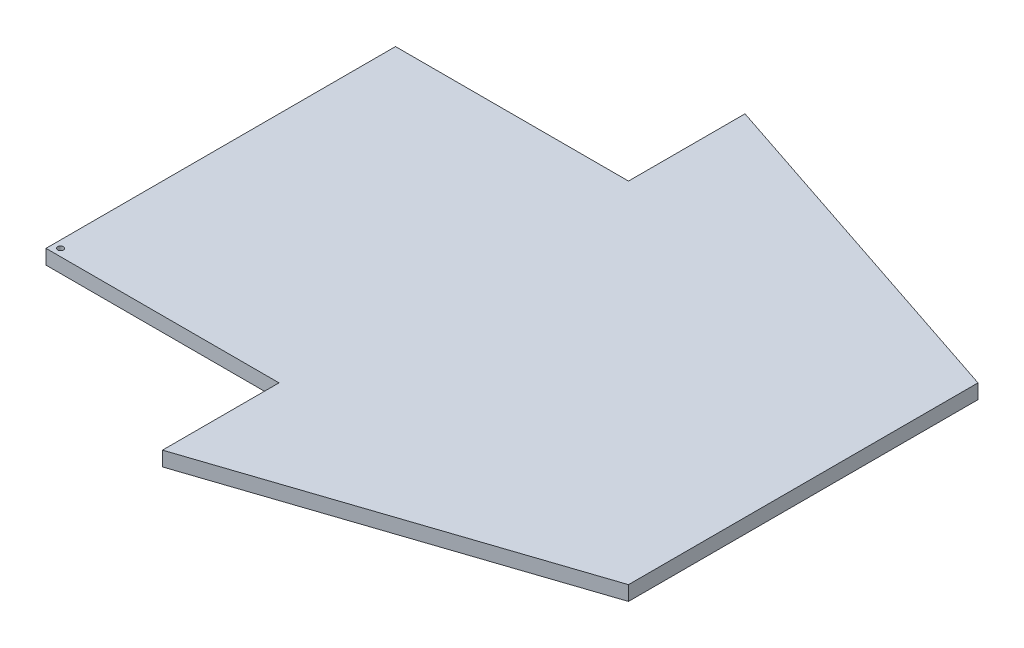
ISO-10303-21;
HEADER;
FILE_DESCRIPTION(('STEP AP214'),'2;1');
FILE_NAME('part.step','',(''),(''),'','','');
FILE_SCHEMA(('AUTOMOTIVE_DESIGN { 1 0 10303 214 1 1 1 1 }'));
ENDSEC;
DATA;
#1=APPLICATION_CONTEXT('core data for automotive mechanical design processes');
#2=APPLICATION_PROTOCOL_DEFINITION('international standard','automotive_design',2000,#1);
#3=PRODUCT_CONTEXT('',#1,'mechanical');
#4=PRODUCT('Part','Part','',(#3));
#5=PRODUCT_RELATED_PRODUCT_CATEGORY('part','',(#4));
#6=PRODUCT_DEFINITION_FORMATION('','',#4);
#7=PRODUCT_DEFINITION_CONTEXT('part definition',#1,'design');
#8=PRODUCT_DEFINITION('design','',#6,#7);
#9=PRODUCT_DEFINITION_SHAPE('','',#8);
#10=(LENGTH_UNIT() NAMED_UNIT(*) SI_UNIT(.MILLI.,.METRE.));
#11=(NAMED_UNIT(*) PLANE_ANGLE_UNIT() SI_UNIT($,.RADIAN.));
#12=(NAMED_UNIT(*) SI_UNIT($,.STERADIAN.) SOLID_ANGLE_UNIT());
#13=UNCERTAINTY_MEASURE_WITH_UNIT(LENGTH_MEASURE(1.E-05),#10,'distance_accuracy_value','');
#14=(GEOMETRIC_REPRESENTATION_CONTEXT(3) GLOBAL_UNCERTAINTY_ASSIGNED_CONTEXT((#13)) GLOBAL_UNIT_ASSIGNED_CONTEXT((#10,
#11,#12)) REPRESENTATION_CONTEXT('',''));
#15=CARTESIAN_POINT('',(0.,0.,0.));
#16=DIRECTION('',(0.,0.,1.));
#17=DIRECTION('',(1.,0.,0.));
#18=AXIS2_PLACEMENT_3D('',#15,#16,#17);
#19=CARTESIAN_POINT('',(0.,6.35,0.));
#20=DIRECTION('',(1.,0.,0.));
#21=DIRECTION('',(0.,0.,-1.));
#22=AXIS2_PLACEMENT_3D('',#19,#20,#21);
#23=PLANE('',#22);
#24=DIRECTION('',(0.,0.,1.));
#25=VECTOR('',#24,1.);
#26=CARTESIAN_POINT('',(0.,0.,0.));
#27=LINE('',#26,#25);
#28=CARTESIAN_POINT('',(0.,0.,-50.8));
#29=VERTEX_POINT('',#28);
#30=CARTESIAN_POINT('',(0.,0.,0.));
#31=VERTEX_POINT('',#30);
#32=EDGE_CURVE('E130',#29,#31,#27,.T.);
#33=ORIENTED_EDGE('',*,*,#32,.T.);
#34=DIRECTION('',(0.,-1.,0.));
#35=VECTOR('',#34,1.);
#36=CARTESIAN_POINT('',(0.,6.35,0.));
#37=LINE('',#36,#35);
#38=CARTESIAN_POINT('',(0.,6.35,0.));
#39=VERTEX_POINT('',#38);
#40=EDGE_CURVE('E11',#39,#31,#37,.T.);
#41=ORIENTED_EDGE('',*,*,#40,.F.);
#42=DIRECTION('',(0.,0.,1.));
#43=VECTOR('',#42,1.);
#44=CARTESIAN_POINT('',(0.,6.35,0.));
#45=LINE('',#44,#43);
#46=CARTESIAN_POINT('',(0.,6.35,-50.8));
#47=VERTEX_POINT('',#46);
#48=EDGE_CURVE('E145',#47,#39,#45,.T.);
#49=ORIENTED_EDGE('',*,*,#48,.F.);
#50=DIRECTION('',(0.,-1.,0.));
#51=VECTOR('',#50,1.);
#52=CARTESIAN_POINT('',(0.,6.35,-50.8));
#53=LINE('',#52,#51);
#54=EDGE_CURVE('E126',#47,#29,#53,.T.);
#55=ORIENTED_EDGE('',*,*,#54,.T.);
#56=EDGE_LOOP('',(#33,#41,#49,#55));
#57=FACE_BOUND('',#56,.T.);
#58=ADVANCED_FACE('F34',(#57),#23,.F.);
#59=CARTESIAN_POINT('',(152.4,6.35,-50.8));
#60=DIRECTION('',(-0.316227766016838,0.,-0.948683298050514));
#61=DIRECTION('',(-0.948683298050514,0.,0.316227766016838));
#62=AXIS2_PLACEMENT_3D('',#59,#60,#61);
#63=PLANE('',#62);
#64=DIRECTION('',(0.948683298050514,0.,-0.316227766016838));
#65=VECTOR('',#64,1.);
#66=CARTESIAN_POINT('',(152.4,0.,-50.8));
#67=LINE('',#66,#65);
#68=CARTESIAN_POINT('',(152.4,0.,-50.8));
#69=VERTEX_POINT('',#68);
#70=EDGE_CURVE('E133',#31,#69,#67,.T.);
#71=ORIENTED_EDGE('',*,*,#70,.T.);
#72=DIRECTION('',(0.,-1.,0.));
#73=VECTOR('',#72,1.);
#74=CARTESIAN_POINT('',(152.4,6.35,-50.8));
#75=LINE('',#74,#73);
#76=CARTESIAN_POINT('',(152.4,6.35,-50.8));
#77=VERTEX_POINT('',#76);
#78=EDGE_CURVE('E42',#77,#69,#75,.T.);
#79=ORIENTED_EDGE('',*,*,#78,.F.);
#80=DIRECTION('',(0.948683298050514,0.,-0.316227766016838));
#81=VECTOR('',#80,1.);
#82=CARTESIAN_POINT('',(152.4,6.35,-50.8));
#83=LINE('',#82,#81);
#84=EDGE_CURVE('E93',#39,#77,#83,.T.);
#85=ORIENTED_EDGE('',*,*,#84,.F.);
#86=ORIENTED_EDGE('',*,*,#40,.T.);
#87=EDGE_LOOP('',(#71,#79,#85,#86));
#88=FACE_BOUND('',#87,.T.);
#89=ADVANCED_FACE('F200',(#88),#63,.F.);
#90=CARTESIAN_POINT('',(152.4,6.35,-203.2));
#91=DIRECTION('',(-1.,0.,0.));
#92=DIRECTION('',(0.,0.,1.));
#93=AXIS2_PLACEMENT_3D('',#90,#91,#92);
#94=PLANE('',#93);
#95=DIRECTION('',(0.,0.,-1.));
#96=VECTOR('',#95,1.);
#97=CARTESIAN_POINT('',(152.4,0.,-203.2));
#98=LINE('',#97,#96);
#99=CARTESIAN_POINT('',(152.4,0.,-203.2));
#100=VERTEX_POINT('',#99);
#101=EDGE_CURVE('E136',#69,#100,#98,.T.);
#102=ORIENTED_EDGE('',*,*,#101,.T.);
#103=DIRECTION('',(0.,-1.,0.));
#104=VECTOR('',#103,1.);
#105=CARTESIAN_POINT('',(152.4,6.35,-203.2));
#106=LINE('',#105,#104);
#107=CARTESIAN_POINT('',(152.4,6.35,-203.2));
#108=VERTEX_POINT('',#107);
#109=EDGE_CURVE('E152',#108,#100,#106,.T.);
#110=ORIENTED_EDGE('',*,*,#109,.F.);
#111=DIRECTION('',(0.,0.,-1.));
#112=VECTOR('',#111,1.);
#113=CARTESIAN_POINT('',(152.4,6.35,-203.2));
#114=LINE('',#113,#112);
#115=EDGE_CURVE('E160',#77,#108,#114,.T.);
#116=ORIENTED_EDGE('',*,*,#115,.F.);
#117=ORIENTED_EDGE('',*,*,#78,.T.);
#118=EDGE_LOOP('',(#102,#110,#116,#117));
#119=FACE_BOUND('',#118,.T.);
#120=ADVANCED_FACE('F158',(#119),#94,.F.);
#121=CARTESIAN_POINT('',(0.,6.35,-254.));
#122=DIRECTION('',(-0.316227766016838,0.,0.948683298050514));
#123=DIRECTION('',(0.948683298050514,0.,0.316227766016838));
#124=AXIS2_PLACEMENT_3D('',#121,#122,#123);
#125=PLANE('',#124);
#126=DIRECTION('',(-0.948683298050514,0.,-0.316227766016838));
#127=VECTOR('',#126,1.);
#128=CARTESIAN_POINT('',(0.,0.,-254.));
#129=LINE('',#128,#127);
#130=CARTESIAN_POINT('',(0.,0.,-254.));
#131=VERTEX_POINT('',#130);
#132=EDGE_CURVE('E138',#100,#131,#129,.T.);
#133=ORIENTED_EDGE('',*,*,#132,.T.);
#134=DIRECTION('',(0.,-1.,0.));
#135=VECTOR('',#134,1.);
#136=CARTESIAN_POINT('',(0.,6.35,-254.));
#137=LINE('',#136,#135);
#138=CARTESIAN_POINT('',(0.,6.35,-254.));
#139=VERTEX_POINT('',#138);
#140=EDGE_CURVE('E149',#139,#131,#137,.T.);
#141=ORIENTED_EDGE('',*,*,#140,.F.);
#142=DIRECTION('',(-0.948683298050514,0.,-0.316227766016838));
#143=VECTOR('',#142,1.);
#144=CARTESIAN_POINT('',(0.,6.35,-254.));
#145=LINE('',#144,#143);
#146=EDGE_CURVE('E172',#108,#139,#145,.T.);
#147=ORIENTED_EDGE('',*,*,#146,.F.);
#148=ORIENTED_EDGE('',*,*,#109,.T.);
#149=EDGE_LOOP('',(#133,#141,#147,#148));
#150=FACE_BOUND('',#149,.T.);
#151=ADVANCED_FACE('F168',(#150),#125,.F.);
#152=CARTESIAN_POINT('',(0.,6.35,-203.2));
#153=DIRECTION('',(1.,0.,0.));
#154=DIRECTION('',(0.,0.,-1.));
#155=AXIS2_PLACEMENT_3D('',#152,#153,#154);
#156=PLANE('',#155);
#157=DIRECTION('',(0.,0.,1.));
#158=VECTOR('',#157,1.);
#159=CARTESIAN_POINT('',(0.,0.,-203.2));
#160=LINE('',#159,#158);
#161=CARTESIAN_POINT('',(0.,0.,-203.2));
#162=VERTEX_POINT('',#161);
#163=EDGE_CURVE('E140',#131,#162,#160,.T.);
#164=ORIENTED_EDGE('',*,*,#163,.T.);
#165=DIRECTION('',(0.,-1.,0.));
#166=VECTOR('',#165,1.);
#167=CARTESIAN_POINT('',(0.,6.35,-203.2));
#168=LINE('',#167,#166);
#169=CARTESIAN_POINT('',(0.,6.35,-203.2));
#170=VERTEX_POINT('',#169);
#171=EDGE_CURVE('E121',#170,#162,#168,.T.);
#172=ORIENTED_EDGE('',*,*,#171,.F.);
#173=DIRECTION('',(0.,0.,1.));
#174=VECTOR('',#173,1.);
#175=CARTESIAN_POINT('',(0.,6.35,-203.2));
#176=LINE('',#175,#174);
#177=EDGE_CURVE('E112',#139,#170,#176,.T.);
#178=ORIENTED_EDGE('',*,*,#177,.F.);
#179=ORIENTED_EDGE('',*,*,#140,.T.);
#180=EDGE_LOOP('',(#164,#172,#178,#179));
#181=FACE_BOUND('',#180,.T.);
#182=ADVANCED_FACE('F171',(#181),#156,.F.);
#183=CARTESIAN_POINT('',(-101.6,6.35,-203.2));
#184=DIRECTION('',(0.,0.,1.));
#185=DIRECTION('',(1.,0.,0.));
#186=AXIS2_PLACEMENT_3D('',#183,#184,#185);
#187=PLANE('',#186);
#188=DIRECTION('',(-1.,0.,0.));
#189=VECTOR('',#188,1.);
#190=CARTESIAN_POINT('',(-101.6,0.,-203.2));
#191=LINE('',#190,#189);
#192=CARTESIAN_POINT('',(-101.6,0.,-203.2));
#193=VERTEX_POINT('',#192);
#194=EDGE_CURVE('E120',#162,#193,#191,.T.);
#195=ORIENTED_EDGE('',*,*,#194,.T.);
#196=DIRECTION('',(0.,-1.,0.));
#197=VECTOR('',#196,1.);
#198=CARTESIAN_POINT('',(-101.6,6.35,-203.2));
#199=LINE('',#198,#197);
#200=CARTESIAN_POINT('',(-101.6,6.35,-203.2));
#201=VERTEX_POINT('',#200);
#202=EDGE_CURVE('E117',#201,#193,#199,.T.);
#203=ORIENTED_EDGE('',*,*,#202,.F.);
#204=DIRECTION('',(-1.,0.,0.));
#205=VECTOR('',#204,1.);
#206=CARTESIAN_POINT('',(-101.6,6.35,-203.2));
#207=LINE('',#206,#205);
#208=EDGE_CURVE('E106',#170,#201,#207,.T.);
#209=ORIENTED_EDGE('',*,*,#208,.F.);
#210=ORIENTED_EDGE('',*,*,#171,.T.);
#211=EDGE_LOOP('',(#195,#203,#209,#210));
#212=FACE_BOUND('',#211,.T.);
#213=ADVANCED_FACE('F118',(#212),#187,.F.);
#214=CARTESIAN_POINT('',(-101.6,6.35,-50.7999999999999));
#215=DIRECTION('',(1.,0.,0.));
#216=DIRECTION('',(0.,0.,-1.));
#217=AXIS2_PLACEMENT_3D('',#214,#215,#216);
#218=PLANE('',#217);
#219=DIRECTION('',(0.,0.,1.));
#220=VECTOR('',#219,1.);
#221=CARTESIAN_POINT('',(-101.6,0.,-50.7999999999999));
#222=LINE('',#221,#220);
#223=CARTESIAN_POINT('',(-101.6,0.,-50.7999999999999));
#224=VERTEX_POINT('',#223);
#225=EDGE_CURVE('E79',#193,#224,#222,.T.);
#226=ORIENTED_EDGE('',*,*,#225,.T.);
#227=DIRECTION('',(0.,-1.,0.));
#228=VECTOR('',#227,1.);
#229=CARTESIAN_POINT('',(-101.6,6.35,-50.7999999999999));
#230=LINE('',#229,#228);
#231=CARTESIAN_POINT('',(-101.6,6.35,-50.7999999999999));
#232=VERTEX_POINT('',#231);
#233=EDGE_CURVE('E122',#232,#224,#230,.T.);
#234=ORIENTED_EDGE('',*,*,#233,.F.);
#235=DIRECTION('',(0.,0.,1.));
#236=VECTOR('',#235,1.);
#237=CARTESIAN_POINT('',(-101.6,6.35,-50.7999999999999));
#238=LINE('',#237,#236);
#239=EDGE_CURVE('E110',#201,#232,#238,.T.);
#240=ORIENTED_EDGE('',*,*,#239,.F.);
#241=ORIENTED_EDGE('',*,*,#202,.T.);
#242=EDGE_LOOP('',(#226,#234,#240,#241));
#243=FACE_BOUND('',#242,.T.);
#244=ADVANCED_FACE('F124',(#243),#218,.F.);
#245=CARTESIAN_POINT('',(0.,6.35,-50.8));
#246=DIRECTION('',(0.,0.,-1.));
#247=DIRECTION('',(-1.,0.,0.));
#248=AXIS2_PLACEMENT_3D('',#245,#246,#247);
#249=PLANE('',#248);
#250=DIRECTION('',(1.,0.,0.));
#251=VECTOR('',#250,1.);
#252=CARTESIAN_POINT('',(0.,0.,-50.8));
#253=LINE('',#252,#251);
#254=EDGE_CURVE('E85',#224,#29,#253,.T.);
#255=ORIENTED_EDGE('',*,*,#254,.T.);
#256=ORIENTED_EDGE('',*,*,#54,.F.);
#257=DIRECTION('',(1.,0.,0.));
#258=VECTOR('',#257,1.);
#259=CARTESIAN_POINT('',(0.,6.35,-50.8));
#260=LINE('',#259,#258);
#261=EDGE_CURVE('E50',#232,#47,#260,.T.);
#262=ORIENTED_EDGE('',*,*,#261,.F.);
#263=ORIENTED_EDGE('',*,*,#233,.T.);
#264=EDGE_LOOP('',(#255,#256,#262,#263));
#265=FACE_BOUND('',#264,.T.);
#266=ADVANCED_FACE('F196',(#265),#249,.F.);
#267=CARTESIAN_POINT('',(0.,6.35,0.));
#268=DIRECTION('',(0.,1.,0.));
#269=DIRECTION('',(0.,0.,1.));
#270=AXIS2_PLACEMENT_3D('',#267,#268,#269);
#271=PLANE('',#270);
#272=CARTESIAN_POINT('',(-98.425,6.35,-53.9749999999999));
#273=DIRECTION('',(0.,-1.,0.));
#274=DIRECTION('',(0.,0.,-1.));
#275=AXIS2_PLACEMENT_3D('',#272,#273,#274);
#276=CIRCLE('',#275,1.26999999999999);
#277=CARTESIAN_POINT('',(-98.425,6.35,-55.2449999999999));
#278=VERTEX_POINT('',#277);
#279=EDGE_CURVE('E134',#278,#278,#276,.T.);
#280=ORIENTED_EDGE('',*,*,#279,.T.);
#281=EDGE_LOOP('',(#280));
#282=FACE_BOUND('',#281,.T.);
#283=ORIENTED_EDGE('',*,*,#48,.T.);
#284=ORIENTED_EDGE('',*,*,#84,.T.);
#285=ORIENTED_EDGE('',*,*,#115,.T.);
#286=ORIENTED_EDGE('',*,*,#146,.T.);
#287=ORIENTED_EDGE('',*,*,#177,.T.);
#288=ORIENTED_EDGE('',*,*,#208,.T.);
#289=ORIENTED_EDGE('',*,*,#239,.T.);
#290=ORIENTED_EDGE('',*,*,#261,.T.);
#291=EDGE_LOOP('',(#283,#284,#285,#286,#287,#288,#289,#290));
#292=FACE_BOUND('',#291,.T.);
#293=ADVANCED_FACE('F108',(#282,#292),#271,.T.);
#294=CARTESIAN_POINT('',(0.,0.,0.));
#295=DIRECTION('',(0.,1.,0.));
#296=DIRECTION('',(0.,0.,1.));
#297=AXIS2_PLACEMENT_3D('',#294,#295,#296);
#298=PLANE('',#297);
#299=CARTESIAN_POINT('',(-98.425,0.,-53.9749999999999));
#300=DIRECTION('',(0.,-1.,0.));
#301=DIRECTION('',(0.,0.,-1.));
#302=AXIS2_PLACEMENT_3D('',#299,#300,#301);
#303=CIRCLE('',#302,1.26999999999999);
#304=CARTESIAN_POINT('',(-98.425,0.,-55.2449999999999));
#305=VERTEX_POINT('',#304);
#306=EDGE_CURVE('E178',#305,#305,#303,.T.);
#307=ORIENTED_EDGE('',*,*,#306,.F.);
#308=EDGE_LOOP('',(#307));
#309=FACE_BOUND('',#308,.T.);
#310=ORIENTED_EDGE('',*,*,#32,.F.);
#311=ORIENTED_EDGE('',*,*,#254,.F.);
#312=ORIENTED_EDGE('',*,*,#225,.F.);
#313=ORIENTED_EDGE('',*,*,#194,.F.);
#314=ORIENTED_EDGE('',*,*,#163,.F.);
#315=ORIENTED_EDGE('',*,*,#132,.F.);
#316=ORIENTED_EDGE('',*,*,#101,.F.);
#317=ORIENTED_EDGE('',*,*,#70,.F.);
#318=EDGE_LOOP('',(#310,#311,#312,#313,#314,#315,#316,#317));
#319=FACE_BOUND('',#318,.T.);
#320=ADVANCED_FACE('F164',(#309,#319),#298,.F.);
#321=CARTESIAN_POINT('',(-98.425,6.35,-53.9749999999999));
#322=DIRECTION('',(0.,-1.,0.));
#323=DIRECTION('',(0.,0.,-1.));
#324=AXIS2_PLACEMENT_3D('',#321,#322,#323);
#325=CYLINDRICAL_SURFACE('',#324,1.26999999999999);
#326=ORIENTED_EDGE('',*,*,#279,.F.);
#327=EDGE_LOOP('',(#326));
#328=FACE_BOUND('',#327,.T.);
#329=ORIENTED_EDGE('',*,*,#306,.T.);
#330=EDGE_LOOP('',(#329));
#331=FACE_BOUND('',#330,.T.);
#332=ADVANCED_FACE('F185',(#328,#331),#325,.F.);
#333=CLOSED_SHELL('',(#58,#89,#120,#151,#182,#213,#244,#266,#293,#320,#332));
#334=MANIFOLD_SOLID_BREP('B2',#333);
#335=ADVANCED_BREP_SHAPE_REPRESENTATION('',(#18,#334),#14);
#336=SHAPE_DEFINITION_REPRESENTATION(#9,#335);
ENDSEC;
END-ISO-10303-21;
